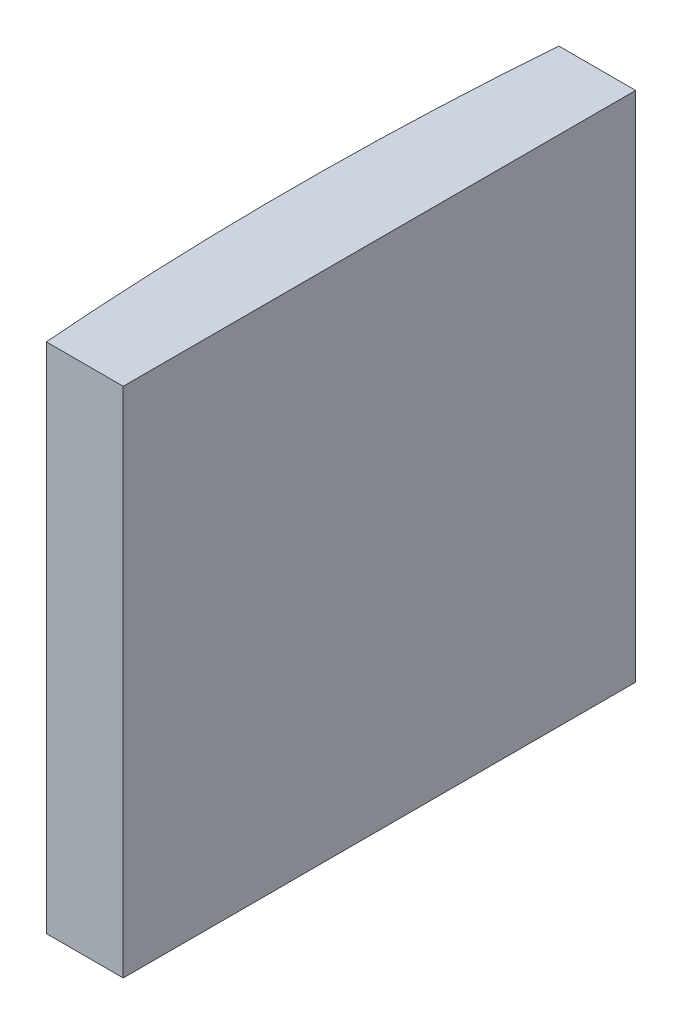
ISO-10303-21;
HEADER;
FILE_DESCRIPTION(('STEP AP214'),'2;1');
FILE_NAME('part.step','',(''),(''),'','','');
FILE_SCHEMA(('AUTOMOTIVE_DESIGN { 1 0 10303 214 1 1 1 1 }'));
ENDSEC;
DATA;
#1=APPLICATION_CONTEXT('core data for automotive mechanical design processes');
#2=APPLICATION_PROTOCOL_DEFINITION('international standard','automotive_design',2000,#1);
#3=PRODUCT_CONTEXT('',#1,'mechanical');
#4=PRODUCT('Part','Part','',(#3));
#5=PRODUCT_RELATED_PRODUCT_CATEGORY('part','',(#4));
#6=PRODUCT_DEFINITION_FORMATION('','',#4);
#7=PRODUCT_DEFINITION_CONTEXT('part definition',#1,'design');
#8=PRODUCT_DEFINITION('design','',#6,#7);
#9=PRODUCT_DEFINITION_SHAPE('','',#8);
#10=(LENGTH_UNIT() NAMED_UNIT(*) SI_UNIT(.MILLI.,.METRE.));
#11=(NAMED_UNIT(*) PLANE_ANGLE_UNIT() SI_UNIT($,.RADIAN.));
#12=(NAMED_UNIT(*) SI_UNIT($,.STERADIAN.) SOLID_ANGLE_UNIT());
#13=UNCERTAINTY_MEASURE_WITH_UNIT(LENGTH_MEASURE(1.E-05),#10,'distance_accuracy_value','');
#14=(GEOMETRIC_REPRESENTATION_CONTEXT(3) GLOBAL_UNCERTAINTY_ASSIGNED_CONTEXT((#13)) GLOBAL_UNIT_ASSIGNED_CONTEXT((#10,
#11,#12)) REPRESENTATION_CONTEXT('',''));
#15=CARTESIAN_POINT('',(0.,0.,0.));
#16=DIRECTION('',(0.,0.,1.));
#17=DIRECTION('',(1.,0.,0.));
#18=AXIS2_PLACEMENT_3D('',#15,#16,#17);
#19=CARTESIAN_POINT('',(4.35520433485127,20.,0.));
#20=DIRECTION('',(0.,-1.,0.));
#21=DIRECTION('',(0.,0.,-1.));
#22=AXIS2_PLACEMENT_3D('',#19,#20,#21);
#23=CYLINDRICAL_SURFACE('',#22,129.25);
#24=CARTESIAN_POINT('',(4.35520433485127,0.,0.));
#25=DIRECTION('',(0.,1.,0.));
#26=DIRECTION('',(0.,0.,1.));
#27=AXIS2_PLACEMENT_3D('',#24,#25,#26);
#28=CIRCLE('',#27,129.25);
#29=CARTESIAN_POINT('',(-124.507367810826,0.,-10.));
#30=VERTEX_POINT('',#29);
#31=CARTESIAN_POINT('',(-124.507367810826,0.,10.));
#32=VERTEX_POINT('',#31);
#33=EDGE_CURVE('E100',#30,#32,#28,.T.);
#34=ORIENTED_EDGE('',*,*,#33,.T.);
#35=DIRECTION('',(0.,-1.,0.));
#36=VECTOR('',#35,1.);
#37=CARTESIAN_POINT('',(-124.507367810826,20.,10.));
#38=LINE('',#37,#36);
#39=CARTESIAN_POINT('',(-124.507367810826,20.,10.));
#40=VERTEX_POINT('',#39);
#41=EDGE_CURVE('E11',#40,#32,#38,.T.);
#42=ORIENTED_EDGE('',*,*,#41,.F.);
#43=CARTESIAN_POINT('',(4.35520433485127,20.,0.));
#44=DIRECTION('',(0.,1.,0.));
#45=DIRECTION('',(0.,0.,1.));
#46=AXIS2_PLACEMENT_3D('',#43,#44,#45);
#47=CIRCLE('',#46,129.25);
#48=CARTESIAN_POINT('',(-124.507367810826,20.,-10.));
#49=VERTEX_POINT('',#48);
#50=EDGE_CURVE('E88',#49,#40,#47,.T.);
#51=ORIENTED_EDGE('',*,*,#50,.F.);
#52=DIRECTION('',(0.,-1.,0.));
#53=VECTOR('',#52,1.);
#54=CARTESIAN_POINT('',(-124.507367810826,20.,-10.));
#55=LINE('',#54,#53);
#56=EDGE_CURVE('E96',#49,#30,#55,.T.);
#57=ORIENTED_EDGE('',*,*,#56,.T.);
#58=EDGE_LOOP('',(#34,#42,#51,#57));
#59=FACE_BOUND('',#58,.T.);
#60=ADVANCED_FACE('F37',(#59),#23,.T.);
#61=CARTESIAN_POINT('',(-124.507367810826,20.,10.));
#62=DIRECTION('',(0.,0.,-1.));
#63=DIRECTION('',(-1.,0.,0.));
#64=AXIS2_PLACEMENT_3D('',#61,#62,#63);
#65=PLANE('',#64);
#66=DIRECTION('',(1.,0.,0.));
#67=VECTOR('',#66,1.);
#68=CARTESIAN_POINT('',(-124.507367810826,0.,10.));
#69=LINE('',#68,#67);
#70=CARTESIAN_POINT('',(-121.504795665149,0.,10.));
#71=VERTEX_POINT('',#70);
#72=EDGE_CURVE('E92',#32,#71,#69,.T.);
#73=ORIENTED_EDGE('',*,*,#72,.T.);
#74=DIRECTION('',(0.,-1.,0.));
#75=VECTOR('',#74,1.);
#76=CARTESIAN_POINT('',(-121.504795665149,20.,10.));
#77=LINE('',#76,#75);
#78=CARTESIAN_POINT('',(-121.504795665149,20.,10.));
#79=VERTEX_POINT('',#78);
#80=EDGE_CURVE('E45',#79,#71,#77,.T.);
#81=ORIENTED_EDGE('',*,*,#80,.F.);
#82=DIRECTION('',(1.,0.,0.));
#83=VECTOR('',#82,1.);
#84=CARTESIAN_POINT('',(-124.507367810826,20.,10.));
#85=LINE('',#84,#83);
#86=EDGE_CURVE('E83',#40,#79,#85,.T.);
#87=ORIENTED_EDGE('',*,*,#86,.F.);
#88=ORIENTED_EDGE('',*,*,#41,.T.);
#89=EDGE_LOOP('',(#73,#81,#87,#88));
#90=FACE_BOUND('',#89,.T.);
#91=ADVANCED_FACE('F91',(#90),#65,.F.);
#92=CARTESIAN_POINT('',(-121.504795665149,20.,-10.));
#93=DIRECTION('',(-1.,0.,0.));
#94=DIRECTION('',(0.,0.,1.));
#95=AXIS2_PLACEMENT_3D('',#92,#93,#94);
#96=PLANE('',#95);
#97=DIRECTION('',(0.,0.,-1.));
#98=VECTOR('',#97,1.);
#99=CARTESIAN_POINT('',(-121.504795665149,0.,-10.));
#100=LINE('',#99,#98);
#101=CARTESIAN_POINT('',(-121.504795665149,0.,-10.));
#102=VERTEX_POINT('',#101);
#103=EDGE_CURVE('E70',#71,#102,#100,.T.);
#104=ORIENTED_EDGE('',*,*,#103,.T.);
#105=DIRECTION('',(0.,-1.,0.));
#106=VECTOR('',#105,1.);
#107=CARTESIAN_POINT('',(-121.504795665149,20.,-10.));
#108=LINE('',#107,#106);
#109=CARTESIAN_POINT('',(-121.504795665149,20.,-10.));
#110=VERTEX_POINT('',#109);
#111=EDGE_CURVE('E93',#110,#102,#108,.T.);
#112=ORIENTED_EDGE('',*,*,#111,.F.);
#113=DIRECTION('',(0.,0.,-1.));
#114=VECTOR('',#113,1.);
#115=CARTESIAN_POINT('',(-121.504795665149,20.,-10.));
#116=LINE('',#115,#114);
#117=EDGE_CURVE('E86',#79,#110,#116,.T.);
#118=ORIENTED_EDGE('',*,*,#117,.F.);
#119=ORIENTED_EDGE('',*,*,#80,.T.);
#120=EDGE_LOOP('',(#104,#112,#118,#119));
#121=FACE_BOUND('',#120,.T.);
#122=ADVANCED_FACE('F94',(#121),#96,.F.);
#123=CARTESIAN_POINT('',(-124.507367810826,20.,-10.));
#124=DIRECTION('',(0.,0.,1.));
#125=DIRECTION('',(1.,0.,0.));
#126=AXIS2_PLACEMENT_3D('',#123,#124,#125);
#127=PLANE('',#126);
#128=DIRECTION('',(-1.,0.,0.));
#129=VECTOR('',#128,1.);
#130=CARTESIAN_POINT('',(-124.507367810826,0.,-10.));
#131=LINE('',#130,#129);
#132=EDGE_CURVE('E76',#102,#30,#131,.T.);
#133=ORIENTED_EDGE('',*,*,#132,.T.);
#134=ORIENTED_EDGE('',*,*,#56,.F.);
#135=DIRECTION('',(-1.,0.,0.));
#136=VECTOR('',#135,1.);
#137=CARTESIAN_POINT('',(-124.507367810826,20.,-10.));
#138=LINE('',#137,#136);
#139=EDGE_CURVE('E53',#110,#49,#138,.T.);
#140=ORIENTED_EDGE('',*,*,#139,.F.);
#141=ORIENTED_EDGE('',*,*,#111,.T.);
#142=EDGE_LOOP('',(#133,#134,#140,#141));
#143=FACE_BOUND('',#142,.T.);
#144=ADVANCED_FACE('F107',(#143),#127,.F.);
#145=CARTESIAN_POINT('',(4.35520433485127,20.,0.));
#146=DIRECTION('',(0.,1.,0.));
#147=DIRECTION('',(0.,0.,1.));
#148=AXIS2_PLACEMENT_3D('',#145,#146,#147);
#149=PLANE('',#148);
#150=ORIENTED_EDGE('',*,*,#50,.T.);
#151=ORIENTED_EDGE('',*,*,#86,.T.);
#152=ORIENTED_EDGE('',*,*,#117,.T.);
#153=ORIENTED_EDGE('',*,*,#139,.T.);
#154=EDGE_LOOP('',(#150,#151,#152,#153));
#155=FACE_BOUND('',#154,.T.);
#156=ADVANCED_FACE('F84',(#155),#149,.T.);
#157=CARTESIAN_POINT('',(4.35520433485127,0.,0.));
#158=DIRECTION('',(0.,1.,0.));
#159=DIRECTION('',(0.,0.,1.));
#160=AXIS2_PLACEMENT_3D('',#157,#158,#159);
#161=PLANE('',#160);
#162=ORIENTED_EDGE('',*,*,#33,.F.);
#163=ORIENTED_EDGE('',*,*,#132,.F.);
#164=ORIENTED_EDGE('',*,*,#103,.F.);
#165=ORIENTED_EDGE('',*,*,#72,.F.);
#166=EDGE_LOOP('',(#162,#163,#164,#165));
#167=FACE_BOUND('',#166,.T.);
#168=ADVANCED_FACE('F110',(#167),#161,.F.);
#169=CLOSED_SHELL('',(#60,#91,#122,#144,#156,#168));
#170=MANIFOLD_SOLID_BREP('B2',#169);
#171=ADVANCED_BREP_SHAPE_REPRESENTATION('',(#18,#170),#14);
#172=SHAPE_DEFINITION_REPRESENTATION(#9,#171);
ENDSEC;
END-ISO-10303-21;
